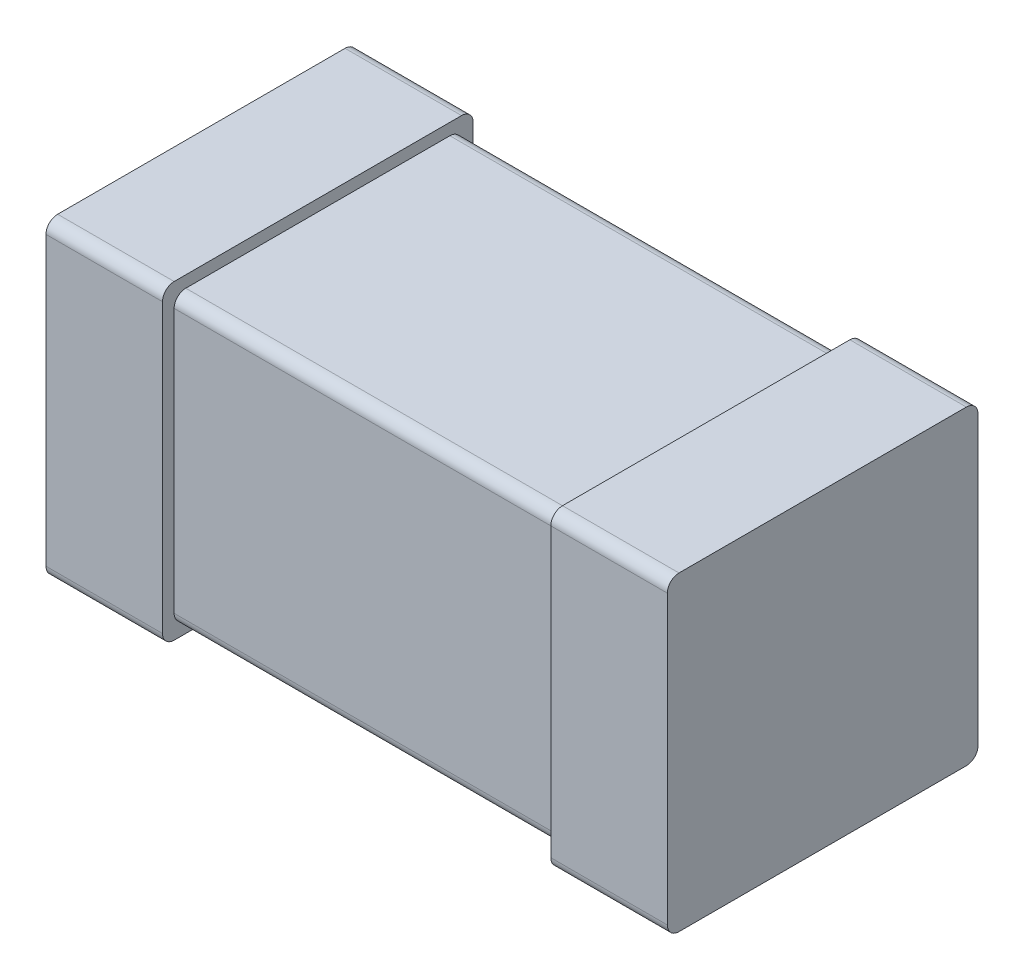
ISO-10303-21;
HEADER;
FILE_DESCRIPTION(('STEP AP214'),'2;1');
FILE_NAME('part.step','',(''),(''),'','','');
FILE_SCHEMA(('AUTOMOTIVE_DESIGN { 1 0 10303 214 1 1 1 1 }'));
ENDSEC;
DATA;
#1=APPLICATION_CONTEXT('core data for automotive mechanical design processes');
#2=APPLICATION_PROTOCOL_DEFINITION('international standard','automotive_design',2000,#1);
#3=PRODUCT_CONTEXT('',#1,'mechanical');
#4=PRODUCT('Part','Part','',(#3));
#5=PRODUCT_RELATED_PRODUCT_CATEGORY('part','',(#4));
#6=PRODUCT_DEFINITION_FORMATION('','',#4);
#7=PRODUCT_DEFINITION_CONTEXT('part definition',#1,'design');
#8=PRODUCT_DEFINITION('design','',#6,#7);
#9=PRODUCT_DEFINITION_SHAPE('','',#8);
#10=(LENGTH_UNIT() NAMED_UNIT(*) SI_UNIT(.MILLI.,.METRE.));
#11=(NAMED_UNIT(*) PLANE_ANGLE_UNIT() SI_UNIT($,.RADIAN.));
#12=(NAMED_UNIT(*) SI_UNIT($,.STERADIAN.) SOLID_ANGLE_UNIT());
#13=UNCERTAINTY_MEASURE_WITH_UNIT(LENGTH_MEASURE(1.E-05),#10,'distance_accuracy_value','');
#14=(GEOMETRIC_REPRESENTATION_CONTEXT(3) GLOBAL_UNCERTAINTY_ASSIGNED_CONTEXT((#13)) GLOBAL_UNIT_ASSIGNED_CONTEXT((#10,
#11,#12)) REPRESENTATION_CONTEXT('',''));
#15=CARTESIAN_POINT('',(0.,0.,0.));
#16=DIRECTION('',(0.,0.,1.));
#17=DIRECTION('',(1.,0.,0.));
#18=AXIS2_PLACEMENT_3D('',#15,#16,#17);
#19=CARTESIAN_POINT('',(-0.8,-0.4,0.));
#20=DIRECTION('',(1.,0.,0.));
#21=DIRECTION('',(0.,0.,-1.));
#22=AXIS2_PLACEMENT_3D('',#19,#20,#21);
#23=PLANE('',#22);
#24=DIRECTION('',(0.,1.,0.));
#25=VECTOR('',#24,1.);
#26=CARTESIAN_POINT('',(-0.8,-0.4,0.8));
#27=LINE('',#26,#25);
#28=CARTESIAN_POINT('',(-0.8,0.37,0.8));
#29=VERTEX_POINT('',#28);
#30=CARTESIAN_POINT('',(-0.8,-0.37,0.8));
#31=VERTEX_POINT('',#30);
#32=EDGE_CURVE('E300',#29,#31,#27,.F.);
#33=ORIENTED_EDGE('',*,*,#32,.F.);
#34=CARTESIAN_POINT('',(-0.8,0.37,0.77));
#35=DIRECTION('',(1.,0.,0.));
#36=DIRECTION('',(0.,0.,-1.));
#37=AXIS2_PLACEMENT_3D('',#34,#35,#36);
#38=CIRCLE('',#37,0.03);
#39=CARTESIAN_POINT('',(-0.8,0.4,0.77));
#40=VERTEX_POINT('',#39);
#41=EDGE_CURVE('E279',#40,#29,#38,.T.);
#42=ORIENTED_EDGE('',*,*,#41,.F.);
#43=DIRECTION('',(0.,0.,1.));
#44=VECTOR('',#43,1.);
#45=CARTESIAN_POINT('',(-0.8,0.4,0.));
#46=LINE('',#45,#44);
#47=CARTESIAN_POINT('',(-0.8,0.4,0.03));
#48=VERTEX_POINT('',#47);
#49=EDGE_CURVE('E201',#48,#40,#46,.T.);
#50=ORIENTED_EDGE('',*,*,#49,.F.);
#51=CARTESIAN_POINT('',(-0.8,0.37,0.03));
#52=DIRECTION('',(1.,0.,0.));
#53=DIRECTION('',(0.,0.,-1.));
#54=AXIS2_PLACEMENT_3D('',#51,#52,#53);
#55=CIRCLE('',#54,0.03);
#56=CARTESIAN_POINT('',(-0.8,0.37,0.));
#57=VERTEX_POINT('',#56);
#58=EDGE_CURVE('E196',#57,#48,#55,.T.);
#59=ORIENTED_EDGE('',*,*,#58,.F.);
#60=DIRECTION('',(0.,1.,0.));
#61=VECTOR('',#60,1.);
#62=CARTESIAN_POINT('',(-0.8,-0.4,0.));
#63=LINE('',#62,#61);
#64=CARTESIAN_POINT('',(-0.8,-0.37,0.));
#65=VERTEX_POINT('',#64);
#66=EDGE_CURVE('E188',#57,#65,#63,.F.);
#67=ORIENTED_EDGE('',*,*,#66,.T.);
#68=CARTESIAN_POINT('',(-0.8,-0.37,0.03));
#69=DIRECTION('',(1.,0.,0.));
#70=DIRECTION('',(0.,0.,-1.));
#71=AXIS2_PLACEMENT_3D('',#68,#69,#70);
#72=CIRCLE('',#71,0.03);
#73=CARTESIAN_POINT('',(-0.8,-0.4,0.03));
#74=VERTEX_POINT('',#73);
#75=EDGE_CURVE('E20',#74,#65,#72,.T.);
#76=ORIENTED_EDGE('',*,*,#75,.F.);
#77=DIRECTION('',(0.,0.,1.));
#78=VECTOR('',#77,1.);
#79=CARTESIAN_POINT('',(-0.8,-0.4,0.));
#80=LINE('',#79,#78);
#81=CARTESIAN_POINT('',(-0.8,-0.4,0.77));
#82=VERTEX_POINT('',#81);
#83=EDGE_CURVE('E171',#74,#82,#80,.T.);
#84=ORIENTED_EDGE('',*,*,#83,.T.);
#85=CARTESIAN_POINT('',(-0.8,-0.37,0.77));
#86=DIRECTION('',(1.,0.,0.));
#87=DIRECTION('',(0.,0.,-1.));
#88=AXIS2_PLACEMENT_3D('',#85,#86,#87);
#89=CIRCLE('',#88,0.03);
#90=EDGE_CURVE('E275',#31,#82,#89,.T.);
#91=ORIENTED_EDGE('',*,*,#90,.F.);
#92=EDGE_LOOP('',(#33,#42,#50,#59,#67,#76,#84,#91));
#93=FACE_BOUND('',#92,.T.);
#94=ADVANCED_FACE('F17',(#93),#23,.F.);
#95=CARTESIAN_POINT('',(0.8,-0.4,0.));
#96=DIRECTION('',(1.,0.,0.));
#97=DIRECTION('',(0.,0.,-1.));
#98=AXIS2_PLACEMENT_3D('',#95,#96,#97);
#99=PLANE('',#98);
#100=DIRECTION('',(0.,1.,0.));
#101=VECTOR('',#100,1.);
#102=CARTESIAN_POINT('',(0.8,-0.4,0.8));
#103=LINE('',#102,#101);
#104=CARTESIAN_POINT('',(0.8,-0.37,0.8));
#105=VERTEX_POINT('',#104);
#106=CARTESIAN_POINT('',(0.8,0.37,0.8));
#107=VERTEX_POINT('',#106);
#108=EDGE_CURVE('E290',#105,#107,#103,.T.);
#109=ORIENTED_EDGE('',*,*,#108,.F.);
#110=CARTESIAN_POINT('',(0.8,-0.37,0.77));
#111=DIRECTION('',(1.,0.,0.));
#112=DIRECTION('',(0.,0.,-1.));
#113=AXIS2_PLACEMENT_3D('',#110,#111,#112);
#114=CIRCLE('',#113,0.03);
#115=CARTESIAN_POINT('',(0.8,-0.4,0.77));
#116=VERTEX_POINT('',#115);
#117=EDGE_CURVE('E259',#116,#105,#114,.F.);
#118=ORIENTED_EDGE('',*,*,#117,.F.);
#119=DIRECTION('',(0.,0.,1.));
#120=VECTOR('',#119,1.);
#121=CARTESIAN_POINT('',(0.8,-0.4,0.));
#122=LINE('',#121,#120);
#123=CARTESIAN_POINT('',(0.8,-0.4,0.03));
#124=VERTEX_POINT('',#123);
#125=EDGE_CURVE('E274',#116,#124,#122,.F.);
#126=ORIENTED_EDGE('',*,*,#125,.T.);
#127=CARTESIAN_POINT('',(0.8,-0.37,0.03));
#128=DIRECTION('',(1.,0.,0.));
#129=DIRECTION('',(0.,0.,-1.));
#130=AXIS2_PLACEMENT_3D('',#127,#128,#129);
#131=CIRCLE('',#130,0.03);
#132=CARTESIAN_POINT('',(0.8,-0.37,0.));
#133=VERTEX_POINT('',#132);
#134=EDGE_CURVE('E271',#133,#124,#131,.F.);
#135=ORIENTED_EDGE('',*,*,#134,.F.);
#136=DIRECTION('',(0.,1.,0.));
#137=VECTOR('',#136,1.);
#138=CARTESIAN_POINT('',(0.8,-0.4,0.));
#139=LINE('',#138,#137);
#140=CARTESIAN_POINT('',(0.8,0.37,0.));
#141=VERTEX_POINT('',#140);
#142=EDGE_CURVE('E270',#133,#141,#139,.T.);
#143=ORIENTED_EDGE('',*,*,#142,.T.);
#144=CARTESIAN_POINT('',(0.8,0.37,0.03));
#145=DIRECTION('',(1.,0.,0.));
#146=DIRECTION('',(0.,0.,-1.));
#147=AXIS2_PLACEMENT_3D('',#144,#145,#146);
#148=CIRCLE('',#147,0.03);
#149=CARTESIAN_POINT('',(0.8,0.4,0.03));
#150=VERTEX_POINT('',#149);
#151=EDGE_CURVE('E267',#150,#141,#148,.F.);
#152=ORIENTED_EDGE('',*,*,#151,.F.);
#153=DIRECTION('',(0.,0.,1.));
#154=VECTOR('',#153,1.);
#155=CARTESIAN_POINT('',(0.8,0.4,0.));
#156=LINE('',#155,#154);
#157=CARTESIAN_POINT('',(0.8,0.4,0.77));
#158=VERTEX_POINT('',#157);
#159=EDGE_CURVE('E295',#158,#150,#156,.F.);
#160=ORIENTED_EDGE('',*,*,#159,.F.);
#161=CARTESIAN_POINT('',(0.8,0.37,0.77));
#162=DIRECTION('',(1.,0.,0.));
#163=DIRECTION('',(0.,0.,-1.));
#164=AXIS2_PLACEMENT_3D('',#161,#162,#163);
#165=CIRCLE('',#164,0.03);
#166=EDGE_CURVE('E263',#107,#158,#165,.F.);
#167=ORIENTED_EDGE('',*,*,#166,.F.);
#168=EDGE_LOOP('',(#109,#118,#126,#135,#143,#152,#160,#167));
#169=FACE_BOUND('',#168,.T.);
#170=ADVANCED_FACE('F444',(#169),#99,.T.);
#171=CARTESIAN_POINT('',(-0.8,-0.4,0.));
#172=DIRECTION('',(0.,1.,0.));
#173=DIRECTION('',(0.,0.,1.));
#174=AXIS2_PLACEMENT_3D('',#171,#172,#173);
#175=PLANE('',#174);
#176=ORIENTED_EDGE('',*,*,#83,.F.);
#177=DIRECTION('',(1.,0.,0.));
#178=VECTOR('',#177,1.);
#179=CARTESIAN_POINT('',(-0.8,-0.4,0.03));
#180=LINE('',#179,#178);
#181=CARTESIAN_POINT('',(-0.5,-0.4,0.03));
#182=VERTEX_POINT('',#181);
#183=EDGE_CURVE('E182',#182,#74,#180,.F.);
#184=ORIENTED_EDGE('',*,*,#183,.F.);
#185=DIRECTION('',(0.,0.,-1.));
#186=VECTOR('',#185,1.);
#187=CARTESIAN_POINT('',(-0.5,-0.4,0.));
#188=LINE('',#187,#186);
#189=CARTESIAN_POINT('',(-0.5,-0.4,0.77));
#190=VERTEX_POINT('',#189);
#191=EDGE_CURVE('E258',#190,#182,#188,.T.);
#192=ORIENTED_EDGE('',*,*,#191,.F.);
#193=DIRECTION('',(1.,0.,0.));
#194=VECTOR('',#193,1.);
#195=CARTESIAN_POINT('',(-0.8,-0.4,0.77));
#196=LINE('',#195,#194);
#197=EDGE_CURVE('E307',#82,#190,#196,.T.);
#198=ORIENTED_EDGE('',*,*,#197,.F.);
#199=EDGE_LOOP('',(#176,#184,#192,#198));
#200=FACE_BOUND('',#199,.T.);
#201=ADVANCED_FACE('F310',(#200),#175,.F.);
#202=CARTESIAN_POINT('',(-0.8,-0.37,0.03));
#203=DIRECTION('',(1.,0.,0.));
#204=DIRECTION('',(0.,0.,-1.));
#205=AXIS2_PLACEMENT_3D('',#202,#203,#204);
#206=CYLINDRICAL_SURFACE('',#205,0.03);
#207=CARTESIAN_POINT('',(-0.5,-0.37,0.03));
#208=DIRECTION('',(1.,0.,0.));
#209=DIRECTION('',(0.,0.,-1.));
#210=AXIS2_PLACEMENT_3D('',#207,#208,#209);
#211=CIRCLE('',#210,0.03);
#212=CARTESIAN_POINT('',(-0.5,-0.37,0.));
#213=VERTEX_POINT('',#212);
#214=EDGE_CURVE('E256',#182,#213,#211,.T.);
#215=ORIENTED_EDGE('',*,*,#214,.F.);
#216=ORIENTED_EDGE('',*,*,#183,.T.);
#217=ORIENTED_EDGE('',*,*,#75,.T.);
#218=DIRECTION('',(1.,0.,0.));
#219=VECTOR('',#218,1.);
#220=CARTESIAN_POINT('',(-0.8,-0.37,0.));
#221=LINE('',#220,#219);
#222=EDGE_CURVE('E180',#65,#213,#221,.T.);
#223=ORIENTED_EDGE('',*,*,#222,.T.);
#224=EDGE_LOOP('',(#215,#216,#217,#223));
#225=FACE_BOUND('',#224,.T.);
#226=ADVANCED_FACE('F179',(#225),#206,.T.);
#227=CARTESIAN_POINT('',(-0.8,-0.4,0.));
#228=DIRECTION('',(0.,0.,1.));
#229=DIRECTION('',(1.,0.,0.));
#230=AXIS2_PLACEMENT_3D('',#227,#228,#229);
#231=PLANE('',#230);
#232=DIRECTION('',(0.,1.,0.));
#233=VECTOR('',#232,1.);
#234=CARTESIAN_POINT('',(-0.5,-0.4,0.));
#235=LINE('',#234,#233);
#236=CARTESIAN_POINT('',(-0.5,0.37,0.));
#237=VERTEX_POINT('',#236);
#238=EDGE_CURVE('E190',#213,#237,#235,.T.);
#239=ORIENTED_EDGE('',*,*,#238,.F.);
#240=ORIENTED_EDGE('',*,*,#222,.F.);
#241=ORIENTED_EDGE('',*,*,#66,.F.);
#242=DIRECTION('',(1.,0.,0.));
#243=VECTOR('',#242,1.);
#244=CARTESIAN_POINT('',(-0.8,0.37,0.));
#245=LINE('',#244,#243);
#246=EDGE_CURVE('E191',#237,#57,#245,.F.);
#247=ORIENTED_EDGE('',*,*,#246,.F.);
#248=EDGE_LOOP('',(#239,#240,#241,#247));
#249=FACE_BOUND('',#248,.T.);
#250=ADVANCED_FACE('F186',(#249),#231,.F.);
#251=CARTESIAN_POINT('',(-0.8,0.37,0.03));
#252=DIRECTION('',(1.,0.,0.));
#253=DIRECTION('',(0.,0.,-1.));
#254=AXIS2_PLACEMENT_3D('',#251,#252,#253);
#255=CYLINDRICAL_SURFACE('',#254,0.03);
#256=ORIENTED_EDGE('',*,*,#246,.T.);
#257=ORIENTED_EDGE('',*,*,#58,.T.);
#258=DIRECTION('',(1.,0.,0.));
#259=VECTOR('',#258,1.);
#260=CARTESIAN_POINT('',(-0.8,0.4,0.03));
#261=LINE('',#260,#259);
#262=CARTESIAN_POINT('',(-0.5,0.4,0.03));
#263=VERTEX_POINT('',#262);
#264=EDGE_CURVE('E281',#263,#48,#261,.F.);
#265=ORIENTED_EDGE('',*,*,#264,.F.);
#266=CARTESIAN_POINT('',(-0.5,0.37,0.03));
#267=DIRECTION('',(1.,0.,0.));
#268=DIRECTION('',(0.,0.,-1.));
#269=AXIS2_PLACEMENT_3D('',#266,#267,#268);
#270=CIRCLE('',#269,0.03);
#271=EDGE_CURVE('E254',#237,#263,#270,.T.);
#272=ORIENTED_EDGE('',*,*,#271,.F.);
#273=EDGE_LOOP('',(#256,#257,#265,#272));
#274=FACE_BOUND('',#273,.T.);
#275=ADVANCED_FACE('F678',(#274),#255,.T.);
#276=CARTESIAN_POINT('',(-0.8,0.4,0.));
#277=DIRECTION('',(0.,1.,0.));
#278=DIRECTION('',(0.,0.,1.));
#279=AXIS2_PLACEMENT_3D('',#276,#277,#278);
#280=PLANE('',#279);
#281=ORIENTED_EDGE('',*,*,#49,.T.);
#282=DIRECTION('',(1.,0.,0.));
#283=VECTOR('',#282,1.);
#284=CARTESIAN_POINT('',(-0.8,0.4,0.77));
#285=LINE('',#284,#283);
#286=CARTESIAN_POINT('',(-0.5,0.4,0.77));
#287=VERTEX_POINT('',#286);
#288=EDGE_CURVE('E280',#287,#40,#285,.F.);
#289=ORIENTED_EDGE('',*,*,#288,.F.);
#290=DIRECTION('',(0.,0.,-1.));
#291=VECTOR('',#290,1.);
#292=CARTESIAN_POINT('',(-0.5,0.4,0.));
#293=LINE('',#292,#291);
#294=EDGE_CURVE('E253',#263,#287,#293,.F.);
#295=ORIENTED_EDGE('',*,*,#294,.F.);
#296=ORIENTED_EDGE('',*,*,#264,.T.);
#297=EDGE_LOOP('',(#281,#289,#295,#296));
#298=FACE_BOUND('',#297,.T.);
#299=ADVANCED_FACE('F670',(#298),#280,.T.);
#300=CARTESIAN_POINT('',(-0.8,0.37,0.77));
#301=DIRECTION('',(1.,0.,0.));
#302=DIRECTION('',(0.,0.,-1.));
#303=AXIS2_PLACEMENT_3D('',#300,#301,#302);
#304=CYLINDRICAL_SURFACE('',#303,0.03);
#305=CARTESIAN_POINT('',(-0.5,0.37,0.77));
#306=DIRECTION('',(1.,0.,0.));
#307=DIRECTION('',(0.,0.,-1.));
#308=AXIS2_PLACEMENT_3D('',#305,#306,#307);
#309=CIRCLE('',#308,0.03);
#310=CARTESIAN_POINT('',(-0.5,0.37,0.8));
#311=VERTEX_POINT('',#310);
#312=EDGE_CURVE('E251',#287,#311,#309,.T.);
#313=ORIENTED_EDGE('',*,*,#312,.F.);
#314=ORIENTED_EDGE('',*,*,#288,.T.);
#315=ORIENTED_EDGE('',*,*,#41,.T.);
#316=DIRECTION('',(1.,0.,0.));
#317=VECTOR('',#316,1.);
#318=CARTESIAN_POINT('',(-0.8,0.37,0.8));
#319=LINE('',#318,#317);
#320=EDGE_CURVE('E301',#311,#29,#319,.F.);
#321=ORIENTED_EDGE('',*,*,#320,.F.);
#322=EDGE_LOOP('',(#313,#314,#315,#321));
#323=FACE_BOUND('',#322,.T.);
#324=ADVANCED_FACE('F322',(#323),#304,.T.);
#325=CARTESIAN_POINT('',(-0.8,-0.4,0.8));
#326=DIRECTION('',(0.,0.,1.));
#327=DIRECTION('',(1.,0.,0.));
#328=AXIS2_PLACEMENT_3D('',#325,#326,#327);
#329=PLANE('',#328);
#330=DIRECTION('',(0.,1.,0.));
#331=VECTOR('',#330,1.);
#332=CARTESIAN_POINT('',(-0.5,-0.4,0.8));
#333=LINE('',#332,#331);
#334=CARTESIAN_POINT('',(-0.5,-0.37,0.8));
#335=VERTEX_POINT('',#334);
#336=EDGE_CURVE('E250',#311,#335,#333,.F.);
#337=ORIENTED_EDGE('',*,*,#336,.F.);
#338=ORIENTED_EDGE('',*,*,#320,.T.);
#339=ORIENTED_EDGE('',*,*,#32,.T.);
#340=DIRECTION('',(1.,0.,0.));
#341=VECTOR('',#340,1.);
#342=CARTESIAN_POINT('',(-0.8,-0.37,0.8));
#343=LINE('',#342,#341);
#344=EDGE_CURVE('E278',#335,#31,#343,.F.);
#345=ORIENTED_EDGE('',*,*,#344,.F.);
#346=EDGE_LOOP('',(#337,#338,#339,#345));
#347=FACE_BOUND('',#346,.T.);
#348=ADVANCED_FACE('F328',(#347),#329,.T.);
#349=CARTESIAN_POINT('',(-0.8,-0.37,0.77));
#350=DIRECTION('',(1.,0.,0.));
#351=DIRECTION('',(0.,0.,-1.));
#352=AXIS2_PLACEMENT_3D('',#349,#350,#351);
#353=CYLINDRICAL_SURFACE('',#352,0.03);
#354=ORIENTED_EDGE('',*,*,#344,.T.);
#355=ORIENTED_EDGE('',*,*,#90,.T.);
#356=ORIENTED_EDGE('',*,*,#197,.T.);
#357=CARTESIAN_POINT('',(-0.5,-0.37,0.77));
#358=DIRECTION('',(1.,0.,0.));
#359=DIRECTION('',(0.,0.,-1.));
#360=AXIS2_PLACEMENT_3D('',#357,#358,#359);
#361=CIRCLE('',#360,0.03);
#362=EDGE_CURVE('E247',#335,#190,#361,.T.);
#363=ORIENTED_EDGE('',*,*,#362,.F.);
#364=EDGE_LOOP('',(#354,#355,#356,#363));
#365=FACE_BOUND('',#364,.T.);
#366=ADVANCED_FACE('F305',(#365),#353,.T.);
#367=CARTESIAN_POINT('',(0.5,-0.4,0.));
#368=DIRECTION('',(0.,1.,0.));
#369=DIRECTION('',(0.,0.,1.));
#370=AXIS2_PLACEMENT_3D('',#367,#368,#369);
#371=PLANE('',#370);
#372=DIRECTION('',(0.,0.,-1.));
#373=VECTOR('',#372,1.);
#374=CARTESIAN_POINT('',(0.5,-0.4,0.));
#375=LINE('',#374,#373);
#376=CARTESIAN_POINT('',(0.5,-0.4,0.77));
#377=VERTEX_POINT('',#376);
#378=CARTESIAN_POINT('',(0.5,-0.4,0.03));
#379=VERTEX_POINT('',#378);
#380=EDGE_CURVE('E236',#377,#379,#375,.T.);
#381=ORIENTED_EDGE('',*,*,#380,.T.);
#382=DIRECTION('',(1.,0.,0.));
#383=VECTOR('',#382,1.);
#384=CARTESIAN_POINT('',(0.5,-0.4,0.03));
#385=LINE('',#384,#383);
#386=EDGE_CURVE('E273',#124,#379,#385,.F.);
#387=ORIENTED_EDGE('',*,*,#386,.F.);
#388=ORIENTED_EDGE('',*,*,#125,.F.);
#389=DIRECTION('',(1.,0.,0.));
#390=VECTOR('',#389,1.);
#391=CARTESIAN_POINT('',(0.5,-0.4,0.77));
#392=LINE('',#391,#390);
#393=EDGE_CURVE('E262',#377,#116,#392,.T.);
#394=ORIENTED_EDGE('',*,*,#393,.F.);
#395=EDGE_LOOP('',(#381,#387,#388,#394));
#396=FACE_BOUND('',#395,.T.);
#397=ADVANCED_FACE('F369',(#396),#371,.F.);
#398=CARTESIAN_POINT('',(0.5,-0.37,0.03));
#399=DIRECTION('',(1.,0.,0.));
#400=DIRECTION('',(0.,0.,-1.));
#401=AXIS2_PLACEMENT_3D('',#398,#399,#400);
#402=CYLINDRICAL_SURFACE('',#401,0.03);
#403=ORIENTED_EDGE('',*,*,#134,.T.);
#404=ORIENTED_EDGE('',*,*,#386,.T.);
#405=CARTESIAN_POINT('',(0.5,-0.37,0.03));
#406=DIRECTION('',(1.,0.,0.));
#407=DIRECTION('',(0.,0.,-1.));
#408=AXIS2_PLACEMENT_3D('',#405,#406,#407);
#409=CIRCLE('',#408,0.03);
#410=CARTESIAN_POINT('',(0.5,-0.37,0.));
#411=VERTEX_POINT('',#410);
#412=EDGE_CURVE('E233',#379,#411,#409,.T.);
#413=ORIENTED_EDGE('',*,*,#412,.T.);
#414=DIRECTION('',(1.,0.,0.));
#415=VECTOR('',#414,1.);
#416=CARTESIAN_POINT('',(0.5,-0.37,0.));
#417=LINE('',#416,#415);
#418=EDGE_CURVE('E299',#411,#133,#417,.T.);
#419=ORIENTED_EDGE('',*,*,#418,.T.);
#420=EDGE_LOOP('',(#403,#404,#413,#419));
#421=FACE_BOUND('',#420,.T.);
#422=ADVANCED_FACE('F358',(#421),#402,.T.);
#423=CARTESIAN_POINT('',(0.5,-0.4,0.));
#424=DIRECTION('',(0.,0.,1.));
#425=DIRECTION('',(1.,0.,0.));
#426=AXIS2_PLACEMENT_3D('',#423,#424,#425);
#427=PLANE('',#426);
#428=ORIENTED_EDGE('',*,*,#142,.F.);
#429=ORIENTED_EDGE('',*,*,#418,.F.);
#430=DIRECTION('',(0.,1.,0.));
#431=VECTOR('',#430,1.);
#432=CARTESIAN_POINT('',(0.5,-0.4,0.));
#433=LINE('',#432,#431);
#434=CARTESIAN_POINT('',(0.5,0.37,0.));
#435=VERTEX_POINT('',#434);
#436=EDGE_CURVE('E232',#411,#435,#433,.T.);
#437=ORIENTED_EDGE('',*,*,#436,.T.);
#438=DIRECTION('',(1.,0.,0.));
#439=VECTOR('',#438,1.);
#440=CARTESIAN_POINT('',(0.5,0.37,0.));
#441=LINE('',#440,#439);
#442=EDGE_CURVE('E269',#141,#435,#441,.F.);
#443=ORIENTED_EDGE('',*,*,#442,.F.);
#444=EDGE_LOOP('',(#428,#429,#437,#443));
#445=FACE_BOUND('',#444,.T.);
#446=ADVANCED_FACE('F441',(#445),#427,.F.);
#447=CARTESIAN_POINT('',(0.5,0.37,0.03));
#448=DIRECTION('',(1.,0.,0.));
#449=DIRECTION('',(0.,0.,-1.));
#450=AXIS2_PLACEMENT_3D('',#447,#448,#449);
#451=CYLINDRICAL_SURFACE('',#450,0.03);
#452=ORIENTED_EDGE('',*,*,#442,.T.);
#453=CARTESIAN_POINT('',(0.5,0.37,0.03));
#454=DIRECTION('',(1.,0.,0.));
#455=DIRECTION('',(0.,0.,-1.));
#456=AXIS2_PLACEMENT_3D('',#453,#454,#455);
#457=CIRCLE('',#456,0.03);
#458=CARTESIAN_POINT('',(0.5,0.4,0.03));
#459=VERTEX_POINT('',#458);
#460=EDGE_CURVE('E229',#435,#459,#457,.T.);
#461=ORIENTED_EDGE('',*,*,#460,.T.);
#462=DIRECTION('',(1.,0.,0.));
#463=VECTOR('',#462,1.);
#464=CARTESIAN_POINT('',(0.5,0.4,0.03));
#465=LINE('',#464,#463);
#466=EDGE_CURVE('E266',#150,#459,#465,.F.);
#467=ORIENTED_EDGE('',*,*,#466,.F.);
#468=ORIENTED_EDGE('',*,*,#151,.T.);
#469=EDGE_LOOP('',(#452,#461,#467,#468));
#470=FACE_BOUND('',#469,.T.);
#471=ADVANCED_FACE('F436',(#470),#451,.T.);
#472=CARTESIAN_POINT('',(0.5,0.4,0.));
#473=DIRECTION('',(0.,1.,0.));
#474=DIRECTION('',(0.,0.,1.));
#475=AXIS2_PLACEMENT_3D('',#472,#473,#474);
#476=PLANE('',#475);
#477=DIRECTION('',(0.,0.,-1.));
#478=VECTOR('',#477,1.);
#479=CARTESIAN_POINT('',(0.5,0.4,0.));
#480=LINE('',#479,#478);
#481=CARTESIAN_POINT('',(0.5,0.4,0.77));
#482=VERTEX_POINT('',#481);
#483=EDGE_CURVE('E228',#459,#482,#480,.F.);
#484=ORIENTED_EDGE('',*,*,#483,.T.);
#485=DIRECTION('',(1.,0.,0.));
#486=VECTOR('',#485,1.);
#487=CARTESIAN_POINT('',(0.5,0.4,0.77));
#488=LINE('',#487,#486);
#489=EDGE_CURVE('E265',#158,#482,#488,.F.);
#490=ORIENTED_EDGE('',*,*,#489,.F.);
#491=ORIENTED_EDGE('',*,*,#159,.T.);
#492=ORIENTED_EDGE('',*,*,#466,.T.);
#493=EDGE_LOOP('',(#484,#490,#491,#492));
#494=FACE_BOUND('',#493,.T.);
#495=ADVANCED_FACE('F432',(#494),#476,.T.);
#496=CARTESIAN_POINT('',(0.5,0.37,0.77));
#497=DIRECTION('',(1.,0.,0.));
#498=DIRECTION('',(0.,0.,-1.));
#499=AXIS2_PLACEMENT_3D('',#496,#497,#498);
#500=CYLINDRICAL_SURFACE('',#499,0.03);
#501=ORIENTED_EDGE('',*,*,#166,.T.);
#502=ORIENTED_EDGE('',*,*,#489,.T.);
#503=CARTESIAN_POINT('',(0.5,0.37,0.77));
#504=DIRECTION('',(1.,0.,0.));
#505=DIRECTION('',(0.,0.,-1.));
#506=AXIS2_PLACEMENT_3D('',#503,#504,#505);
#507=CIRCLE('',#506,0.03);
#508=CARTESIAN_POINT('',(0.5,0.37,0.8));
#509=VERTEX_POINT('',#508);
#510=EDGE_CURVE('E225',#482,#509,#507,.T.);
#511=ORIENTED_EDGE('',*,*,#510,.T.);
#512=DIRECTION('',(1.,0.,0.));
#513=VECTOR('',#512,1.);
#514=CARTESIAN_POINT('',(0.5,0.37,0.8));
#515=LINE('',#514,#513);
#516=EDGE_CURVE('E292',#107,#509,#515,.F.);
#517=ORIENTED_EDGE('',*,*,#516,.F.);
#518=EDGE_LOOP('',(#501,#502,#511,#517));
#519=FACE_BOUND('',#518,.T.);
#520=ADVANCED_FACE('F455',(#519),#500,.T.);
#521=CARTESIAN_POINT('',(0.5,-0.4,0.8));
#522=DIRECTION('',(0.,0.,1.));
#523=DIRECTION('',(1.,0.,0.));
#524=AXIS2_PLACEMENT_3D('',#521,#522,#523);
#525=PLANE('',#524);
#526=ORIENTED_EDGE('',*,*,#108,.T.);
#527=ORIENTED_EDGE('',*,*,#516,.T.);
#528=DIRECTION('',(0.,1.,0.));
#529=VECTOR('',#528,1.);
#530=CARTESIAN_POINT('',(0.5,-0.4,0.8));
#531=LINE('',#530,#529);
#532=CARTESIAN_POINT('',(0.5,-0.37,0.8));
#533=VERTEX_POINT('',#532);
#534=EDGE_CURVE('E224',#509,#533,#531,.F.);
#535=ORIENTED_EDGE('',*,*,#534,.T.);
#536=DIRECTION('',(1.,0.,0.));
#537=VECTOR('',#536,1.);
#538=CARTESIAN_POINT('',(0.5,-0.37,0.8));
#539=LINE('',#538,#537);
#540=EDGE_CURVE('E261',#105,#533,#539,.F.);
#541=ORIENTED_EDGE('',*,*,#540,.F.);
#542=EDGE_LOOP('',(#526,#527,#535,#541));
#543=FACE_BOUND('',#542,.T.);
#544=ADVANCED_FACE('F451',(#543),#525,.T.);
#545=CARTESIAN_POINT('',(0.5,-0.37,0.77));
#546=DIRECTION('',(1.,0.,0.));
#547=DIRECTION('',(0.,0.,-1.));
#548=AXIS2_PLACEMENT_3D('',#545,#546,#547);
#549=CYLINDRICAL_SURFACE('',#548,0.03);
#550=ORIENTED_EDGE('',*,*,#540,.T.);
#551=CARTESIAN_POINT('',(0.5,-0.37,0.77));
#552=DIRECTION('',(1.,0.,0.));
#553=DIRECTION('',(0.,0.,-1.));
#554=AXIS2_PLACEMENT_3D('',#551,#552,#553);
#555=CIRCLE('',#554,0.03);
#556=EDGE_CURVE('E221',#533,#377,#555,.T.);
#557=ORIENTED_EDGE('',*,*,#556,.T.);
#558=ORIENTED_EDGE('',*,*,#393,.T.);
#559=ORIENTED_EDGE('',*,*,#117,.T.);
#560=EDGE_LOOP('',(#550,#557,#558,#559));
#561=FACE_BOUND('',#560,.T.);
#562=ADVANCED_FACE('F448',(#561),#549,.T.);
#563=CARTESIAN_POINT('',(-0.5,-0.37,0.03));
#564=DIRECTION('',(0.,1.,0.));
#565=DIRECTION('',(0.,0.,1.));
#566=AXIS2_PLACEMENT_3D('',#563,#564,#565);
#567=PLANE('',#566);
#568=DIRECTION('',(0.,0.,-1.));
#569=VECTOR('',#568,1.);
#570=CARTESIAN_POINT('',(-0.5,-0.37,0.));
#571=LINE('',#570,#569);
#572=CARTESIAN_POINT('',(-0.5,-0.37,0.06));
#573=VERTEX_POINT('',#572);
#574=CARTESIAN_POINT('',(-0.5,-0.37,0.74));
#575=VERTEX_POINT('',#574);
#576=EDGE_CURVE('E246',#573,#575,#571,.F.);
#577=ORIENTED_EDGE('',*,*,#576,.F.);
#578=DIRECTION('',(1.,0.,0.));
#579=VECTOR('',#578,1.);
#580=CARTESIAN_POINT('',(-0.5,-0.37,0.06));
#581=LINE('',#580,#579);
#582=CARTESIAN_POINT('',(0.5,-0.37,0.06));
#583=VERTEX_POINT('',#582);
#584=EDGE_CURVE('E239',#583,#573,#581,.F.);
#585=ORIENTED_EDGE('',*,*,#584,.F.);
#586=DIRECTION('',(0.,0.,-1.));
#587=VECTOR('',#586,1.);
#588=CARTESIAN_POINT('',(0.5,-0.37,0.));
#589=LINE('',#588,#587);
#590=CARTESIAN_POINT('',(0.5,-0.37,0.74));
#591=VERTEX_POINT('',#590);
#592=EDGE_CURVE('E217',#583,#591,#589,.F.);
#593=ORIENTED_EDGE('',*,*,#592,.T.);
#594=DIRECTION('',(1.,0.,0.));
#595=VECTOR('',#594,1.);
#596=CARTESIAN_POINT('',(-0.5,-0.37,0.74));
#597=LINE('',#596,#595);
#598=EDGE_CURVE('E344',#575,#591,#597,.T.);
#599=ORIENTED_EDGE('',*,*,#598,.F.);
#600=EDGE_LOOP('',(#577,#585,#593,#599));
#601=FACE_BOUND('',#600,.T.);
#602=ADVANCED_FACE('F420',(#601),#567,.F.);
#603=CARTESIAN_POINT('',(-0.5,-0.34,0.74));
#604=DIRECTION('',(1.,0.,0.));
#605=DIRECTION('',(0.,0.,-1.));
#606=AXIS2_PLACEMENT_3D('',#603,#604,#605);
#607=CYLINDRICAL_SURFACE('',#606,0.03);
#608=DIRECTION('',(1.,0.,0.));
#609=VECTOR('',#608,1.);
#610=CARTESIAN_POINT('',(-0.5,-0.34,0.77));
#611=LINE('',#610,#609);
#612=CARTESIAN_POINT('',(-0.5,-0.34,0.77));
#613=VERTEX_POINT('',#612);
#614=CARTESIAN_POINT('',(0.5,-0.34,0.77));
#615=VERTEX_POINT('',#614);
#616=EDGE_CURVE('E342',#613,#615,#611,.T.);
#617=ORIENTED_EDGE('',*,*,#616,.F.);
#618=CARTESIAN_POINT('',(-0.5,-0.34,0.74));
#619=DIRECTION('',(1.,0.,0.));
#620=DIRECTION('',(0.,0.,-1.));
#621=AXIS2_PLACEMENT_3D('',#618,#619,#620);
#622=CIRCLE('',#621,0.03);
#623=EDGE_CURVE('E244',#575,#613,#622,.F.);
#624=ORIENTED_EDGE('',*,*,#623,.F.);
#625=ORIENTED_EDGE('',*,*,#598,.T.);
#626=CARTESIAN_POINT('',(0.5,-0.34,0.74));
#627=DIRECTION('',(1.,0.,0.));
#628=DIRECTION('',(0.,0.,-1.));
#629=AXIS2_PLACEMENT_3D('',#626,#627,#628);
#630=CIRCLE('',#629,0.03);
#631=EDGE_CURVE('E214',#591,#615,#630,.F.);
#632=ORIENTED_EDGE('',*,*,#631,.T.);
#633=EDGE_LOOP('',(#617,#624,#625,#632));
#634=FACE_BOUND('',#633,.T.);
#635=ADVANCED_FACE('F422',(#634),#607,.T.);
#636=CARTESIAN_POINT('',(-0.5,-0.37,0.77));
#637=DIRECTION('',(0.,0.,1.));
#638=DIRECTION('',(1.,0.,0.));
#639=AXIS2_PLACEMENT_3D('',#636,#637,#638);
#640=PLANE('',#639);
#641=DIRECTION('',(0.,1.,0.));
#642=VECTOR('',#641,1.);
#643=CARTESIAN_POINT('',(0.5,-0.4,0.77));
#644=LINE('',#643,#642);
#645=CARTESIAN_POINT('',(0.5,0.34,0.77));
#646=VERTEX_POINT('',#645);
#647=EDGE_CURVE('E213',#615,#646,#644,.T.);
#648=ORIENTED_EDGE('',*,*,#647,.T.);
#649=DIRECTION('',(1.,0.,0.));
#650=VECTOR('',#649,1.);
#651=CARTESIAN_POINT('',(-0.5,0.34,0.77));
#652=LINE('',#651,#650);
#653=CARTESIAN_POINT('',(-0.5,0.34,0.77));
#654=VERTEX_POINT('',#653);
#655=EDGE_CURVE('E340',#654,#646,#652,.T.);
#656=ORIENTED_EDGE('',*,*,#655,.F.);
#657=DIRECTION('',(0.,1.,0.));
#658=VECTOR('',#657,1.);
#659=CARTESIAN_POINT('',(-0.5,-0.4,0.77));
#660=LINE('',#659,#658);
#661=EDGE_CURVE('E243',#613,#654,#660,.T.);
#662=ORIENTED_EDGE('',*,*,#661,.F.);
#663=ORIENTED_EDGE('',*,*,#616,.T.);
#664=EDGE_LOOP('',(#648,#656,#662,#663));
#665=FACE_BOUND('',#664,.T.);
#666=ADVANCED_FACE('F393',(#665),#640,.T.);
#667=CARTESIAN_POINT('',(-0.5,0.34,0.74));
#668=DIRECTION('',(1.,0.,0.));
#669=DIRECTION('',(0.,0.,-1.));
#670=AXIS2_PLACEMENT_3D('',#667,#668,#669);
#671=CYLINDRICAL_SURFACE('',#670,0.03);
#672=CARTESIAN_POINT('',(0.5,0.34,0.74));
#673=DIRECTION('',(1.,0.,0.));
#674=DIRECTION('',(0.,0.,-1.));
#675=AXIS2_PLACEMENT_3D('',#672,#673,#674);
#676=CIRCLE('',#675,0.03);
#677=CARTESIAN_POINT('',(0.5,0.37,0.74));
#678=VERTEX_POINT('',#677);
#679=EDGE_CURVE('E209',#646,#678,#676,.F.);
#680=ORIENTED_EDGE('',*,*,#679,.T.);
#681=DIRECTION('',(1.,0.,0.));
#682=VECTOR('',#681,1.);
#683=CARTESIAN_POINT('',(-0.5,0.37,0.74));
#684=LINE('',#683,#682);
#685=CARTESIAN_POINT('',(-0.5,0.37,0.74));
#686=VERTEX_POINT('',#685);
#687=EDGE_CURVE('E337',#686,#678,#684,.T.);
#688=ORIENTED_EDGE('',*,*,#687,.F.);
#689=CARTESIAN_POINT('',(-0.5,0.34,0.74));
#690=DIRECTION('',(1.,0.,0.));
#691=DIRECTION('',(0.,0.,-1.));
#692=AXIS2_PLACEMENT_3D('',#689,#690,#691);
#693=CIRCLE('',#692,0.03);
#694=EDGE_CURVE('E241',#654,#686,#693,.F.);
#695=ORIENTED_EDGE('',*,*,#694,.F.);
#696=ORIENTED_EDGE('',*,*,#655,.T.);
#697=EDGE_LOOP('',(#680,#688,#695,#696));
#698=FACE_BOUND('',#697,.T.);
#699=ADVANCED_FACE('F397',(#698),#671,.T.);
#700=CARTESIAN_POINT('',(-0.5,0.37,0.03));
#701=DIRECTION('',(0.,1.,0.));
#702=DIRECTION('',(0.,0.,1.));
#703=AXIS2_PLACEMENT_3D('',#700,#701,#702);
#704=PLANE('',#703);
#705=DIRECTION('',(0.,0.,-1.));
#706=VECTOR('',#705,1.);
#707=CARTESIAN_POINT('',(-0.5,0.37,0.));
#708=LINE('',#707,#706);
#709=CARTESIAN_POINT('',(-0.5,0.37,0.06));
#710=VERTEX_POINT('',#709);
#711=EDGE_CURVE('E240',#686,#710,#708,.T.);
#712=ORIENTED_EDGE('',*,*,#711,.F.);
#713=ORIENTED_EDGE('',*,*,#687,.T.);
#714=DIRECTION('',(0.,0.,-1.));
#715=VECTOR('',#714,1.);
#716=CARTESIAN_POINT('',(0.5,0.37,0.));
#717=LINE('',#716,#715);
#718=CARTESIAN_POINT('',(0.5,0.37,0.06));
#719=VERTEX_POINT('',#718);
#720=EDGE_CURVE('E212',#678,#719,#717,.T.);
#721=ORIENTED_EDGE('',*,*,#720,.T.);
#722=DIRECTION('',(1.,0.,0.));
#723=VECTOR('',#722,1.);
#724=CARTESIAN_POINT('',(-0.5,0.37,0.06));
#725=LINE('',#724,#723);
#726=EDGE_CURVE('E208',#710,#719,#725,.T.);
#727=ORIENTED_EDGE('',*,*,#726,.F.);
#728=EDGE_LOOP('',(#712,#713,#721,#727));
#729=FACE_BOUND('',#728,.T.);
#730=ADVANCED_FACE('F403',(#729),#704,.T.);
#731=CARTESIAN_POINT('',(-0.5,-0.4,0.));
#732=DIRECTION('',(1.,0.,0.));
#733=DIRECTION('',(0.,0.,-1.));
#734=AXIS2_PLACEMENT_3D('',#731,#732,#733);
#735=PLANE('',#734);
#736=CARTESIAN_POINT('',(-0.5,0.34,0.06));
#737=DIRECTION('',(1.,0.,0.));
#738=DIRECTION('',(0.,0.,-1.));
#739=AXIS2_PLACEMENT_3D('',#736,#737,#738);
#740=CIRCLE('',#739,0.03);
#741=CARTESIAN_POINT('',(-0.5,0.34,0.03));
#742=VERTEX_POINT('',#741);
#743=EDGE_CURVE('E203',#742,#710,#740,.T.);
#744=ORIENTED_EDGE('',*,*,#743,.F.);
#745=DIRECTION('',(0.,1.,0.));
#746=VECTOR('',#745,1.);
#747=CARTESIAN_POINT('',(-0.5,-0.37,0.03));
#748=LINE('',#747,#746);
#749=CARTESIAN_POINT('',(-0.5,-0.34,0.03));
#750=VERTEX_POINT('',#749);
#751=EDGE_CURVE('E206',#742,#750,#748,.F.);
#752=ORIENTED_EDGE('',*,*,#751,.T.);
#753=CARTESIAN_POINT('',(-0.5,-0.34,0.06));
#754=DIRECTION('',(1.,0.,0.));
#755=DIRECTION('',(0.,0.,-1.));
#756=AXIS2_PLACEMENT_3D('',#753,#754,#755);
#757=CIRCLE('',#756,0.03);
#758=EDGE_CURVE('E237',#573,#750,#757,.T.);
#759=ORIENTED_EDGE('',*,*,#758,.F.);
#760=ORIENTED_EDGE('',*,*,#576,.T.);
#761=ORIENTED_EDGE('',*,*,#623,.T.);
#762=ORIENTED_EDGE('',*,*,#661,.T.);
#763=ORIENTED_EDGE('',*,*,#694,.T.);
#764=ORIENTED_EDGE('',*,*,#711,.T.);
#765=EDGE_LOOP('',(#744,#752,#759,#760,#761,#762,#763,#764));
#766=FACE_BOUND('',#765,.T.);
#767=ORIENTED_EDGE('',*,*,#336,.T.);
#768=ORIENTED_EDGE('',*,*,#362,.T.);
#769=ORIENTED_EDGE('',*,*,#191,.T.);
#770=ORIENTED_EDGE('',*,*,#214,.T.);
#771=ORIENTED_EDGE('',*,*,#238,.T.);
#772=ORIENTED_EDGE('',*,*,#271,.T.);
#773=ORIENTED_EDGE('',*,*,#294,.T.);
#774=ORIENTED_EDGE('',*,*,#312,.T.);
#775=EDGE_LOOP('',(#767,#768,#769,#770,#771,#772,#773,#774));
#776=FACE_BOUND('',#775,.T.);
#777=ADVANCED_FACE('F386',(#766,#776),#735,.T.);
#778=CARTESIAN_POINT('',(-0.5,-0.34,0.06));
#779=DIRECTION('',(1.,0.,0.));
#780=DIRECTION('',(0.,0.,-1.));
#781=AXIS2_PLACEMENT_3D('',#778,#779,#780);
#782=CYLINDRICAL_SURFACE('',#781,0.03);
#783=CARTESIAN_POINT('',(0.5,-0.34,0.06));
#784=DIRECTION('',(1.,0.,0.));
#785=DIRECTION('',(0.,0.,-1.));
#786=AXIS2_PLACEMENT_3D('',#783,#784,#785);
#787=CIRCLE('',#786,0.03);
#788=CARTESIAN_POINT('',(0.5,-0.34,0.03));
#789=VERTEX_POINT('',#788);
#790=EDGE_CURVE('E218',#789,#583,#787,.F.);
#791=ORIENTED_EDGE('',*,*,#790,.T.);
#792=ORIENTED_EDGE('',*,*,#584,.T.);
#793=ORIENTED_EDGE('',*,*,#758,.T.);
#794=DIRECTION('',(1.,0.,0.));
#795=VECTOR('',#794,1.);
#796=CARTESIAN_POINT('',(-0.5,-0.34,0.03));
#797=LINE('',#796,#795);
#798=EDGE_CURVE('E374',#750,#789,#797,.T.);
#799=ORIENTED_EDGE('',*,*,#798,.T.);
#800=EDGE_LOOP('',(#791,#792,#793,#799));
#801=FACE_BOUND('',#800,.T.);
#802=ADVANCED_FACE('F416',(#801),#782,.T.);
#803=CARTESIAN_POINT('',(0.5,-0.4,0.));
#804=DIRECTION('',(1.,0.,0.));
#805=DIRECTION('',(0.,0.,-1.));
#806=AXIS2_PLACEMENT_3D('',#803,#804,#805);
#807=PLANE('',#806);
#808=CARTESIAN_POINT('',(0.5,0.34,0.06));
#809=DIRECTION('',(1.,0.,0.));
#810=DIRECTION('',(0.,0.,-1.));
#811=AXIS2_PLACEMENT_3D('',#808,#809,#810);
#812=CIRCLE('',#811,0.03);
#813=CARTESIAN_POINT('',(0.5,0.34,0.03));
#814=VERTEX_POINT('',#813);
#815=EDGE_CURVE('E34',#719,#814,#812,.F.);
#816=ORIENTED_EDGE('',*,*,#815,.F.);
#817=ORIENTED_EDGE('',*,*,#720,.F.);
#818=ORIENTED_EDGE('',*,*,#679,.F.);
#819=ORIENTED_EDGE('',*,*,#647,.F.);
#820=ORIENTED_EDGE('',*,*,#631,.F.);
#821=ORIENTED_EDGE('',*,*,#592,.F.);
#822=ORIENTED_EDGE('',*,*,#790,.F.);
#823=DIRECTION('',(0.,1.,0.));
#824=VECTOR('',#823,1.);
#825=CARTESIAN_POINT('',(0.5,-0.37,0.03));
#826=LINE('',#825,#824);
#827=EDGE_CURVE('E26',#789,#814,#826,.T.);
#828=ORIENTED_EDGE('',*,*,#827,.T.);
#829=EDGE_LOOP('',(#816,#817,#818,#819,#820,#821,#822,#828));
#830=FACE_BOUND('',#829,.T.);
#831=ORIENTED_EDGE('',*,*,#534,.F.);
#832=ORIENTED_EDGE('',*,*,#510,.F.);
#833=ORIENTED_EDGE('',*,*,#483,.F.);
#834=ORIENTED_EDGE('',*,*,#460,.F.);
#835=ORIENTED_EDGE('',*,*,#436,.F.);
#836=ORIENTED_EDGE('',*,*,#412,.F.);
#837=ORIENTED_EDGE('',*,*,#380,.F.);
#838=ORIENTED_EDGE('',*,*,#556,.F.);
#839=EDGE_LOOP('',(#831,#832,#833,#834,#835,#836,#837,#838));
#840=FACE_BOUND('',#839,.T.);
#841=ADVANCED_FACE('F364',(#830,#840),#807,.F.);
#842=CARTESIAN_POINT('',(-0.5,0.34,0.06));
#843=DIRECTION('',(1.,0.,0.));
#844=DIRECTION('',(0.,0.,-1.));
#845=AXIS2_PLACEMENT_3D('',#842,#843,#844);
#846=CYLINDRICAL_SURFACE('',#845,0.03);
#847=DIRECTION('',(1.,0.,0.));
#848=VECTOR('',#847,1.);
#849=CARTESIAN_POINT('',(-0.5,0.34,0.03));
#850=LINE('',#849,#848);
#851=EDGE_CURVE('E11',#814,#742,#850,.F.);
#852=ORIENTED_EDGE('',*,*,#851,.T.);
#853=ORIENTED_EDGE('',*,*,#743,.T.);
#854=ORIENTED_EDGE('',*,*,#726,.T.);
#855=ORIENTED_EDGE('',*,*,#815,.T.);
#856=EDGE_LOOP('',(#852,#853,#854,#855));
#857=FACE_BOUND('',#856,.T.);
#858=ADVANCED_FACE('F404',(#857),#846,.T.);
#859=CARTESIAN_POINT('',(-0.5,-0.37,0.03));
#860=DIRECTION('',(0.,0.,1.));
#861=DIRECTION('',(1.,0.,0.));
#862=AXIS2_PLACEMENT_3D('',#859,#860,#861);
#863=PLANE('',#862);
#864=ORIENTED_EDGE('',*,*,#827,.F.);
#865=ORIENTED_EDGE('',*,*,#798,.F.);
#866=ORIENTED_EDGE('',*,*,#751,.F.);
#867=ORIENTED_EDGE('',*,*,#851,.F.);
#868=EDGE_LOOP('',(#864,#865,#866,#867));
#869=FACE_BOUND('',#868,.T.);
#870=ADVANCED_FACE('F409',(#869),#863,.F.);
#871=CLOSED_SHELL('',(#94,#170,#201,#226,#250,#275,#299,#324,#348,#366,#397,#422,#446,#471,#495,
#520,#544,#562,#602,#635,#666,#699,#730,#777,#802,#841,#858,#870));
#872=MANIFOLD_SOLID_BREP('B1',#871);
#873=ADVANCED_BREP_SHAPE_REPRESENTATION('',(#18,#872),#14);
#874=SHAPE_DEFINITION_REPRESENTATION(#9,#873);
ENDSEC;
END-ISO-10303-21;
